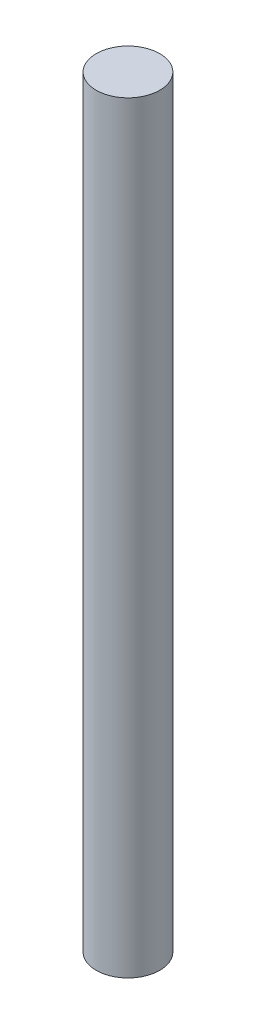
ISO-10303-21;
HEADER;
FILE_DESCRIPTION(('STEP AP214'),'2;1');
FILE_NAME('part.step','',(''),(''),'','','');
FILE_SCHEMA(('AUTOMOTIVE_DESIGN { 1 0 10303 214 1 1 1 1 }'));
ENDSEC;
DATA;
#1=APPLICATION_CONTEXT('core data for automotive mechanical design processes');
#2=APPLICATION_PROTOCOL_DEFINITION('international standard','automotive_design',2000,#1);
#3=PRODUCT_CONTEXT('',#1,'mechanical');
#4=PRODUCT('Part','Part','',(#3));
#5=PRODUCT_RELATED_PRODUCT_CATEGORY('part','',(#4));
#6=PRODUCT_DEFINITION_FORMATION('','',#4);
#7=PRODUCT_DEFINITION_CONTEXT('part definition',#1,'design');
#8=PRODUCT_DEFINITION('design','',#6,#7);
#9=PRODUCT_DEFINITION_SHAPE('','',#8);
#10=(LENGTH_UNIT() NAMED_UNIT(*) SI_UNIT(.MILLI.,.METRE.));
#11=(NAMED_UNIT(*) PLANE_ANGLE_UNIT() SI_UNIT($,.RADIAN.));
#12=(NAMED_UNIT(*) SI_UNIT($,.STERADIAN.) SOLID_ANGLE_UNIT());
#13=UNCERTAINTY_MEASURE_WITH_UNIT(LENGTH_MEASURE(1.E-05),#10,'distance_accuracy_value','');
#14=(GEOMETRIC_REPRESENTATION_CONTEXT(3) GLOBAL_UNCERTAINTY_ASSIGNED_CONTEXT((#13)) GLOBAL_UNIT_ASSIGNED_CONTEXT((#10,
#11,#12)) REPRESENTATION_CONTEXT('',''));
#15=CARTESIAN_POINT('',(0.,0.,0.));
#16=DIRECTION('',(0.,0.,1.));
#17=DIRECTION('',(1.,0.,0.));
#18=AXIS2_PLACEMENT_3D('',#15,#16,#17);
#19=CARTESIAN_POINT('',(0.,9.525,0.));
#20=DIRECTION('',(0.,-1.,0.));
#21=DIRECTION('',(0.,0.,-1.));
#22=AXIS2_PLACEMENT_3D('',#19,#20,#21);
#23=CYLINDRICAL_SURFACE('',#22,0.396875);
#24=CARTESIAN_POINT('',(0.,9.525,0.));
#25=DIRECTION('',(0.,1.,0.));
#26=DIRECTION('',(0.,0.,1.));
#27=AXIS2_PLACEMENT_3D('',#24,#25,#26);
#28=CIRCLE('',#27,0.396875);
#29=CARTESIAN_POINT('',(0.,9.525,0.396875));
#30=VERTEX_POINT('',#29);
#31=EDGE_CURVE('E10',#30,#30,#28,.T.);
#32=ORIENTED_EDGE('',*,*,#31,.F.);
#33=EDGE_LOOP('',(#32));
#34=FACE_BOUND('',#33,.T.);
#35=CARTESIAN_POINT('',(0.,0.,0.));
#36=DIRECTION('',(0.,1.,0.));
#37=DIRECTION('',(0.,0.,1.));
#38=AXIS2_PLACEMENT_3D('',#35,#36,#37);
#39=CIRCLE('',#38,0.396875);
#40=CARTESIAN_POINT('',(0.,0.,0.396875));
#41=VERTEX_POINT('',#40);
#42=EDGE_CURVE('E32',#41,#41,#39,.T.);
#43=ORIENTED_EDGE('',*,*,#42,.T.);
#44=EDGE_LOOP('',(#43));
#45=FACE_BOUND('',#44,.T.);
#46=ADVANCED_FACE('F29',(#34,#45),#23,.T.);
#47=CARTESIAN_POINT('',(0.,9.525,0.));
#48=DIRECTION('',(0.,1.,0.));
#49=DIRECTION('',(0.,0.,1.));
#50=AXIS2_PLACEMENT_3D('',#47,#48,#49);
#51=PLANE('',#50);
#52=ORIENTED_EDGE('',*,*,#31,.T.);
#53=EDGE_LOOP('',(#52));
#54=FACE_BOUND('',#53,.T.);
#55=ADVANCED_FACE('F44',(#54),#51,.T.);
#56=CARTESIAN_POINT('',(0.,0.,0.));
#57=DIRECTION('',(0.,1.,0.));
#58=DIRECTION('',(0.,0.,1.));
#59=AXIS2_PLACEMENT_3D('',#56,#57,#58);
#60=PLANE('',#59);
#61=ORIENTED_EDGE('',*,*,#42,.F.);
#62=EDGE_LOOP('',(#61));
#63=FACE_BOUND('',#62,.T.);
#64=ADVANCED_FACE('F42',(#63),#60,.F.);
#65=CLOSED_SHELL('',(#46,#55,#64));
#66=MANIFOLD_SOLID_BREP('B2',#65);
#67=ADVANCED_BREP_SHAPE_REPRESENTATION('',(#18,#66),#14);
#68=SHAPE_DEFINITION_REPRESENTATION(#9,#67);
ENDSEC;
END-ISO-10303-21;
